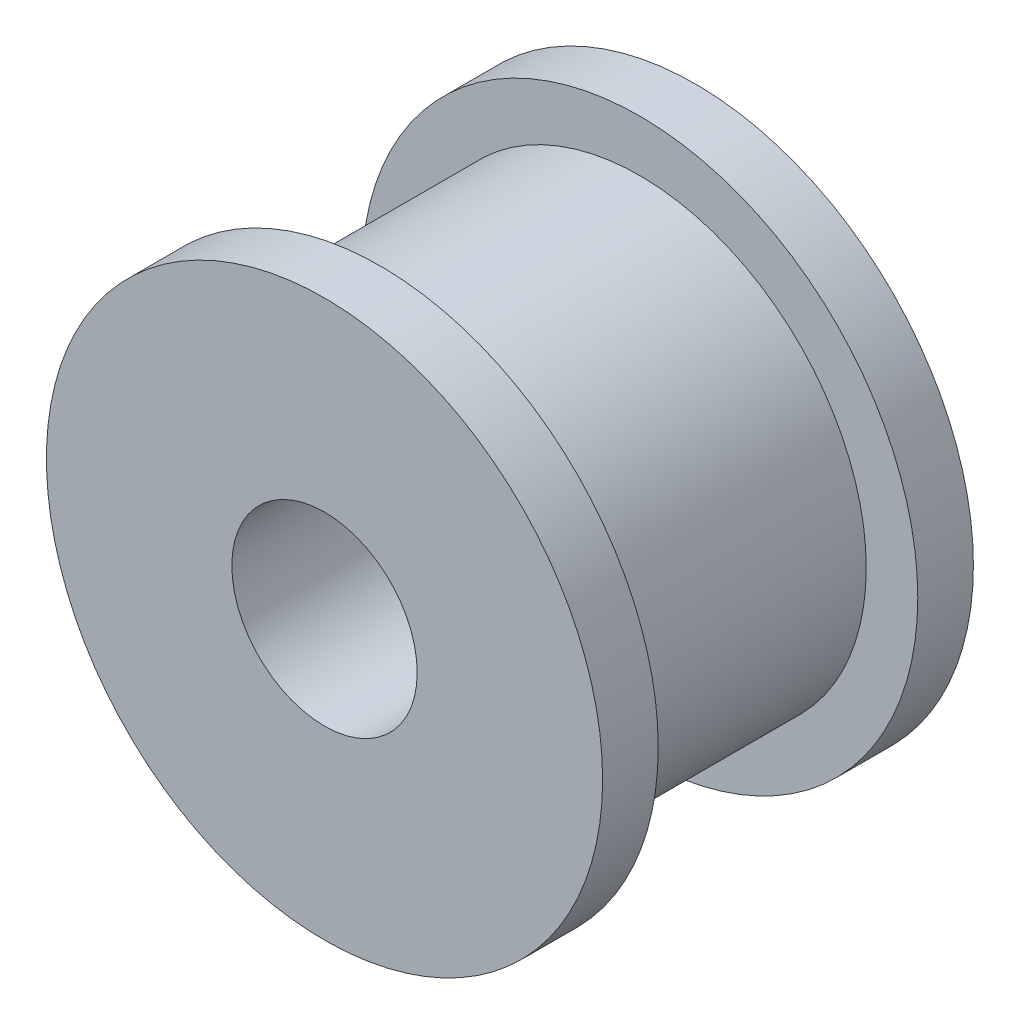
ISO-10303-21;
HEADER;
FILE_DESCRIPTION(('STEP AP214'),'2;1');
FILE_NAME('part.step','',(''),(''),'','','');
FILE_SCHEMA(('AUTOMOTIVE_DESIGN { 1 0 10303 214 1 1 1 1 }'));
ENDSEC;
DATA;
#1=APPLICATION_CONTEXT('core data for automotive mechanical design processes');
#2=APPLICATION_PROTOCOL_DEFINITION('international standard','automotive_design',2000,#1);
#3=PRODUCT_CONTEXT('',#1,'mechanical');
#4=PRODUCT('Part','Part','',(#3));
#5=PRODUCT_RELATED_PRODUCT_CATEGORY('part','',(#4));
#6=PRODUCT_DEFINITION_FORMATION('','',#4);
#7=PRODUCT_DEFINITION_CONTEXT('part definition',#1,'design');
#8=PRODUCT_DEFINITION('design','',#6,#7);
#9=PRODUCT_DEFINITION_SHAPE('','',#8);
#10=(LENGTH_UNIT() NAMED_UNIT(*) SI_UNIT(.MILLI.,.METRE.));
#11=(NAMED_UNIT(*) PLANE_ANGLE_UNIT() SI_UNIT($,.RADIAN.));
#12=(NAMED_UNIT(*) SI_UNIT($,.STERADIAN.) SOLID_ANGLE_UNIT());
#13=UNCERTAINTY_MEASURE_WITH_UNIT(LENGTH_MEASURE(1.E-05),#10,'distance_accuracy_value','');
#14=(GEOMETRIC_REPRESENTATION_CONTEXT(3) GLOBAL_UNCERTAINTY_ASSIGNED_CONTEXT((#13)) GLOBAL_UNIT_ASSIGNED_CONTEXT((#10,
#11,#12)) REPRESENTATION_CONTEXT('',''));
#15=CARTESIAN_POINT('',(0.,0.,0.));
#16=DIRECTION('',(0.,0.,1.));
#17=DIRECTION('',(1.,0.,0.));
#18=AXIS2_PLACEMENT_3D('',#15,#16,#17);
#19=CARTESIAN_POINT('',(0.,0.,-10.));
#20=DIRECTION('',(0.,0.,-1.));
#21=DIRECTION('',(-1.,0.,0.));
#22=AXIS2_PLACEMENT_3D('',#19,#20,#21);
#23=PLANE('',#22);
#24=CARTESIAN_POINT('',(0.,0.,-10.));
#25=DIRECTION('',(0.,0.,-1.));
#26=DIRECTION('',(-1.,0.,0.));
#27=AXIS2_PLACEMENT_3D('',#24,#25,#26);
#28=CIRCLE('',#27,2.49999999999999);
#29=CARTESIAN_POINT('',(-2.49999999999999,0.,-10.));
#30=VERTEX_POINT('',#29);
#31=EDGE_CURVE('E60',#30,#30,#28,.T.);
#32=ORIENTED_EDGE('',*,*,#31,.F.);
#33=EDGE_LOOP('',(#32));
#34=FACE_BOUND('',#33,.T.);
#35=CARTESIAN_POINT('',(0.,0.,-10.));
#36=DIRECTION('',(0.,0.,1.));
#37=DIRECTION('',(1.,0.,0.));
#38=AXIS2_PLACEMENT_3D('',#35,#36,#37);
#39=CIRCLE('',#38,7.5);
#40=CARTESIAN_POINT('',(7.5,0.,-10.));
#41=VERTEX_POINT('',#40);
#42=EDGE_CURVE('E10',#41,#41,#39,.T.);
#43=ORIENTED_EDGE('',*,*,#42,.F.);
#44=EDGE_LOOP('',(#43));
#45=FACE_BOUND('',#44,.T.);
#46=ADVANCED_FACE('F32',(#34,#45),#23,.T.);
#47=CARTESIAN_POINT('',(0.,0.,0.));
#48=DIRECTION('',(0.,0.,1.));
#49=DIRECTION('',(1.,0.,0.));
#50=AXIS2_PLACEMENT_3D('',#47,#48,#49);
#51=CYLINDRICAL_SURFACE('',#50,7.5);
#52=ORIENTED_EDGE('',*,*,#42,.T.);
#53=EDGE_LOOP('',(#52));
#54=FACE_BOUND('',#53,.T.);
#55=CARTESIAN_POINT('',(0.,0.,-8.5));
#56=DIRECTION('',(0.,0.,1.));
#57=DIRECTION('',(1.,0.,0.));
#58=AXIS2_PLACEMENT_3D('',#55,#56,#57);
#59=CIRCLE('',#58,7.5);
#60=CARTESIAN_POINT('',(7.5,0.,-8.5));
#61=VERTEX_POINT('',#60);
#62=EDGE_CURVE('E38',#61,#61,#59,.T.);
#63=ORIENTED_EDGE('',*,*,#62,.F.);
#64=EDGE_LOOP('',(#63));
#65=FACE_BOUND('',#64,.T.);
#66=ADVANCED_FACE('F68',(#54,#65),#51,.T.);
#67=CARTESIAN_POINT('',(7.5,0.,-8.5));
#68=DIRECTION('',(0.,0.,1.));
#69=DIRECTION('',(1.,0.,0.));
#70=AXIS2_PLACEMENT_3D('',#67,#68,#69);
#71=PLANE('',#70);
#72=ORIENTED_EDGE('',*,*,#62,.T.);
#73=EDGE_LOOP('',(#72));
#74=FACE_BOUND('',#73,.T.);
#75=CARTESIAN_POINT('',(0.,0.,-8.5));
#76=DIRECTION('',(0.,0.,1.));
#77=DIRECTION('',(1.,0.,0.));
#78=AXIS2_PLACEMENT_3D('',#75,#76,#77);
#79=CIRCLE('',#78,6.11);
#80=CARTESIAN_POINT('',(6.11,0.,-8.5));
#81=VERTEX_POINT('',#80);
#82=EDGE_CURVE('E42',#81,#81,#79,.T.);
#83=ORIENTED_EDGE('',*,*,#82,.F.);
#84=EDGE_LOOP('',(#83));
#85=FACE_BOUND('',#84,.T.);
#86=ADVANCED_FACE('F72',(#74,#85),#71,.T.);
#87=CARTESIAN_POINT('',(0.,0.,0.));
#88=DIRECTION('',(0.,0.,1.));
#89=DIRECTION('',(1.,0.,0.));
#90=AXIS2_PLACEMENT_3D('',#87,#88,#89);
#91=CYLINDRICAL_SURFACE('',#90,6.11);
#92=ORIENTED_EDGE('',*,*,#82,.T.);
#93=EDGE_LOOP('',(#92));
#94=FACE_BOUND('',#93,.T.);
#95=CARTESIAN_POINT('',(0.,0.,-1.5));
#96=DIRECTION('',(0.,0.,1.));
#97=DIRECTION('',(1.,0.,0.));
#98=AXIS2_PLACEMENT_3D('',#95,#96,#97);
#99=CIRCLE('',#98,6.11);
#100=CARTESIAN_POINT('',(6.10999999999999,0.,-1.5));
#101=VERTEX_POINT('',#100);
#102=EDGE_CURVE('E46',#101,#101,#99,.T.);
#103=ORIENTED_EDGE('',*,*,#102,.F.);
#104=EDGE_LOOP('',(#103));
#105=FACE_BOUND('',#104,.T.);
#106=ADVANCED_FACE('F76',(#94,#105),#91,.T.);
#107=CARTESIAN_POINT('',(6.11,0.,-1.5));
#108=DIRECTION('',(0.,0.,-1.));
#109=DIRECTION('',(-1.,0.,0.));
#110=AXIS2_PLACEMENT_3D('',#107,#108,#109);
#111=PLANE('',#110);
#112=ORIENTED_EDGE('',*,*,#102,.T.);
#113=EDGE_LOOP('',(#112));
#114=FACE_BOUND('',#113,.T.);
#115=CARTESIAN_POINT('',(0.,0.,-1.5));
#116=DIRECTION('',(0.,0.,1.));
#117=DIRECTION('',(1.,0.,0.));
#118=AXIS2_PLACEMENT_3D('',#115,#116,#117);
#119=CIRCLE('',#118,7.5);
#120=CARTESIAN_POINT('',(7.49999999999999,0.,-1.5));
#121=VERTEX_POINT('',#120);
#122=EDGE_CURVE('E51',#121,#121,#119,.T.);
#123=ORIENTED_EDGE('',*,*,#122,.F.);
#124=EDGE_LOOP('',(#123));
#125=FACE_BOUND('',#124,.T.);
#126=ADVANCED_FACE('F82',(#114,#125),#111,.T.);
#127=CARTESIAN_POINT('',(0.,0.,0.));
#128=DIRECTION('',(0.,0.,1.));
#129=DIRECTION('',(1.,0.,0.));
#130=AXIS2_PLACEMENT_3D('',#127,#128,#129);
#131=CYLINDRICAL_SURFACE('',#130,7.5);
#132=ORIENTED_EDGE('',*,*,#122,.T.);
#133=EDGE_LOOP('',(#132));
#134=FACE_BOUND('',#133,.T.);
#135=CARTESIAN_POINT('',(0.,0.,0.));
#136=DIRECTION('',(0.,0.,1.));
#137=DIRECTION('',(1.,0.,0.));
#138=AXIS2_PLACEMENT_3D('',#135,#136,#137);
#139=CIRCLE('',#138,7.5);
#140=CARTESIAN_POINT('',(7.50000000000001,0.,0.));
#141=VERTEX_POINT('',#140);
#142=EDGE_CURVE('E54',#141,#141,#139,.T.);
#143=ORIENTED_EDGE('',*,*,#142,.F.);
#144=EDGE_LOOP('',(#143));
#145=FACE_BOUND('',#144,.T.);
#146=ADVANCED_FACE('F86',(#134,#145),#131,.T.);
#147=CARTESIAN_POINT('',(7.50000000000001,0.,0.));
#148=DIRECTION('',(0.,0.,1.));
#149=DIRECTION('',(1.,0.,0.));
#150=AXIS2_PLACEMENT_3D('',#147,#148,#149);
#151=PLANE('',#150);
#152=CARTESIAN_POINT('',(0.,0.,0.));
#153=DIRECTION('',(0.,0.,-1.));
#154=DIRECTION('',(-1.,0.,0.));
#155=AXIS2_PLACEMENT_3D('',#152,#153,#154);
#156=CIRCLE('',#155,2.5);
#157=CARTESIAN_POINT('',(-2.5,0.,0.));
#158=VERTEX_POINT('',#157);
#159=EDGE_CURVE('E57',#158,#158,#156,.T.);
#160=ORIENTED_EDGE('',*,*,#159,.T.);
#161=EDGE_LOOP('',(#160));
#162=FACE_BOUND('',#161,.T.);
#163=ORIENTED_EDGE('',*,*,#142,.T.);
#164=EDGE_LOOP('',(#163));
#165=FACE_BOUND('',#164,.T.);
#166=ADVANCED_FACE('F90',(#162,#165),#151,.T.);
#167=CARTESIAN_POINT('',(0.,0.,-10.));
#168=DIRECTION('',(0.,0.,-1.));
#169=DIRECTION('',(-1.,0.,0.));
#170=AXIS2_PLACEMENT_3D('',#167,#168,#169);
#171=CYLINDRICAL_SURFACE('',#170,2.49999999999999);
#172=ORIENTED_EDGE('',*,*,#159,.F.);
#173=EDGE_LOOP('',(#172));
#174=FACE_BOUND('',#173,.T.);
#175=ORIENTED_EDGE('',*,*,#31,.T.);
#176=EDGE_LOOP('',(#175));
#177=FACE_BOUND('',#176,.T.);
#178=ADVANCED_FACE('F64',(#174,#177),#171,.F.);
#179=CLOSED_SHELL('',(#46,#66,#86,#106,#126,#146,#166,#178));
#180=MANIFOLD_SOLID_BREP('B2',#179);
#181=ADVANCED_BREP_SHAPE_REPRESENTATION('',(#18,#180),#14);
#182=SHAPE_DEFINITION_REPRESENTATION(#9,#181);
ENDSEC;
END-ISO-10303-21;
